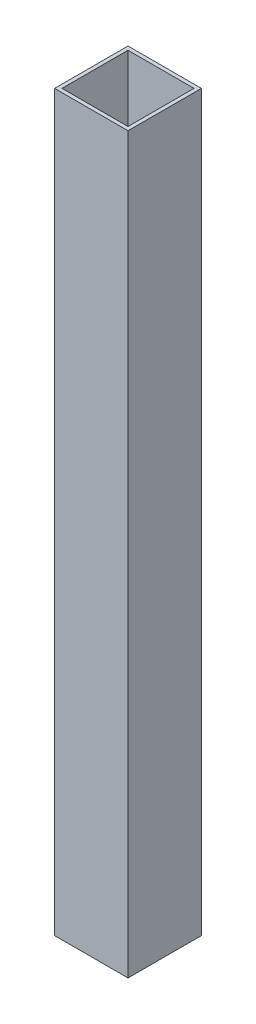
ISO-10303-21;
HEADER;
FILE_DESCRIPTION(('STEP AP214'),'2;1');
FILE_NAME('part.step','',(''),(''),'','','');
FILE_SCHEMA(('AUTOMOTIVE_DESIGN { 1 0 10303 214 1 1 1 1 }'));
ENDSEC;
DATA;
#1=APPLICATION_CONTEXT('core data for automotive mechanical design processes');
#2=APPLICATION_PROTOCOL_DEFINITION('international standard','automotive_design',2000,#1);
#3=PRODUCT_CONTEXT('',#1,'mechanical');
#4=PRODUCT('Part','Part','',(#3));
#5=PRODUCT_RELATED_PRODUCT_CATEGORY('part','',(#4));
#6=PRODUCT_DEFINITION_FORMATION('','',#4);
#7=PRODUCT_DEFINITION_CONTEXT('part definition',#1,'design');
#8=PRODUCT_DEFINITION('design','',#6,#7);
#9=PRODUCT_DEFINITION_SHAPE('','',#8);
#10=(LENGTH_UNIT() NAMED_UNIT(*) SI_UNIT(.MILLI.,.METRE.));
#11=(NAMED_UNIT(*) PLANE_ANGLE_UNIT() SI_UNIT($,.RADIAN.));
#12=(NAMED_UNIT(*) SI_UNIT($,.STERADIAN.) SOLID_ANGLE_UNIT());
#13=UNCERTAINTY_MEASURE_WITH_UNIT(LENGTH_MEASURE(1.E-05),#10,'distance_accuracy_value','');
#14=(GEOMETRIC_REPRESENTATION_CONTEXT(3) GLOBAL_UNCERTAINTY_ASSIGNED_CONTEXT((#13)) GLOBAL_UNIT_ASSIGNED_CONTEXT((#10,
#11,#12)) REPRESENTATION_CONTEXT('',''));
#15=CARTESIAN_POINT('',(0.,0.,0.));
#16=DIRECTION('',(0.,0.,1.));
#17=DIRECTION('',(1.,0.,0.));
#18=AXIS2_PLACEMENT_3D('',#15,#16,#17);
#19=CARTESIAN_POINT('',(0.,200.,0.));
#20=DIRECTION('',(0.,-1.,0.));
#21=DIRECTION('',(0.,0.,-1.));
#22=AXIS2_PLACEMENT_3D('',#19,#20,#21);
#23=PLANE('',#22);
#24=DIRECTION('',(0.,0.,-1.));
#25=VECTOR('',#24,1.);
#26=CARTESIAN_POINT('',(10.,200.,10.));
#27=LINE('',#26,#25);
#28=CARTESIAN_POINT('',(10.,200.,10.));
#29=VERTEX_POINT('',#28);
#30=CARTESIAN_POINT('',(10.,200.,-10.));
#31=VERTEX_POINT('',#30);
#32=EDGE_CURVE('E137',#29,#31,#27,.T.);
#33=ORIENTED_EDGE('',*,*,#32,.T.);
#34=DIRECTION('',(-1.,0.,0.));
#35=VECTOR('',#34,1.);
#36=CARTESIAN_POINT('',(-10.,200.,-10.));
#37=LINE('',#36,#35);
#38=CARTESIAN_POINT('',(-10.,200.,-10.));
#39=VERTEX_POINT('',#38);
#40=EDGE_CURVE('E140',#31,#39,#37,.T.);
#41=ORIENTED_EDGE('',*,*,#40,.T.);
#42=DIRECTION('',(0.,0.,1.));
#43=VECTOR('',#42,1.);
#44=CARTESIAN_POINT('',(-10.,200.,10.));
#45=LINE('',#44,#43);
#46=CARTESIAN_POINT('',(-10.,200.,10.));
#47=VERTEX_POINT('',#46);
#48=EDGE_CURVE('E143',#39,#47,#45,.T.);
#49=ORIENTED_EDGE('',*,*,#48,.T.);
#50=DIRECTION('',(1.,0.,0.));
#51=VECTOR('',#50,1.);
#52=CARTESIAN_POINT('',(-10.,200.,10.));
#53=LINE('',#52,#51);
#54=EDGE_CURVE('E145',#47,#29,#53,.T.);
#55=ORIENTED_EDGE('',*,*,#54,.T.);
#56=EDGE_LOOP('',(#33,#41,#49,#55));
#57=FACE_BOUND('',#56,.T.);
#58=DIRECTION('',(0.,0.,1.));
#59=VECTOR('',#58,1.);
#60=CARTESIAN_POINT('',(-9.,200.,9.));
#61=LINE('',#60,#59);
#62=CARTESIAN_POINT('',(-9.,200.,-9.));
#63=VERTEX_POINT('',#62);
#64=CARTESIAN_POINT('',(-9.,200.,9.));
#65=VERTEX_POINT('',#64);
#66=EDGE_CURVE('E101',#63,#65,#61,.T.);
#67=ORIENTED_EDGE('',*,*,#66,.F.);
#68=DIRECTION('',(-1.,0.,0.));
#69=VECTOR('',#68,1.);
#70=CARTESIAN_POINT('',(-9.,200.,-9.));
#71=LINE('',#70,#69);
#72=CARTESIAN_POINT('',(9.,200.,-9.));
#73=VERTEX_POINT('',#72);
#74=EDGE_CURVE('E123',#73,#63,#71,.T.);
#75=ORIENTED_EDGE('',*,*,#74,.F.);
#76=DIRECTION('',(0.,0.,-1.));
#77=VECTOR('',#76,1.);
#78=CARTESIAN_POINT('',(9.,200.,9.));
#79=LINE('',#78,#77);
#80=CARTESIAN_POINT('',(9.,200.,9.));
#81=VERTEX_POINT('',#80);
#82=EDGE_CURVE('E121',#81,#73,#79,.T.);
#83=ORIENTED_EDGE('',*,*,#82,.F.);
#84=DIRECTION('',(1.,0.,0.));
#85=VECTOR('',#84,1.);
#86=CARTESIAN_POINT('',(-9.,200.,9.));
#87=LINE('',#86,#85);
#88=EDGE_CURVE('E109',#65,#81,#87,.T.);
#89=ORIENTED_EDGE('',*,*,#88,.F.);
#90=EDGE_LOOP('',(#67,#75,#83,#89));
#91=FACE_BOUND('',#90,.T.);
#92=ADVANCED_FACE('F36',(#57,#91),#23,.F.);
#93=CARTESIAN_POINT('',(0.,0.,0.));
#94=DIRECTION('',(0.,-1.,0.));
#95=DIRECTION('',(0.,0.,-1.));
#96=AXIS2_PLACEMENT_3D('',#93,#94,#95);
#97=PLANE('',#96);
#98=DIRECTION('',(0.,0.,-1.));
#99=VECTOR('',#98,1.);
#100=CARTESIAN_POINT('',(10.,0.,10.));
#101=LINE('',#100,#99);
#102=CARTESIAN_POINT('',(10.,0.,10.));
#103=VERTEX_POINT('',#102);
#104=CARTESIAN_POINT('',(10.,0.,-10.));
#105=VERTEX_POINT('',#104);
#106=EDGE_CURVE('E117',#103,#105,#101,.T.);
#107=ORIENTED_EDGE('',*,*,#106,.F.);
#108=DIRECTION('',(1.,0.,0.));
#109=VECTOR('',#108,1.);
#110=CARTESIAN_POINT('',(-10.,0.,10.));
#111=LINE('',#110,#109);
#112=CARTESIAN_POINT('',(-10.,0.,10.));
#113=VERTEX_POINT('',#112);
#114=EDGE_CURVE('E141',#113,#103,#111,.T.);
#115=ORIENTED_EDGE('',*,*,#114,.F.);
#116=DIRECTION('',(0.,0.,1.));
#117=VECTOR('',#116,1.);
#118=CARTESIAN_POINT('',(-10.,0.,10.));
#119=LINE('',#118,#117);
#120=CARTESIAN_POINT('',(-10.,0.,-10.));
#121=VERTEX_POINT('',#120);
#122=EDGE_CURVE('E152',#121,#113,#119,.T.);
#123=ORIENTED_EDGE('',*,*,#122,.F.);
#124=DIRECTION('',(-1.,0.,0.));
#125=VECTOR('',#124,1.);
#126=CARTESIAN_POINT('',(-10.,0.,-10.));
#127=LINE('',#126,#125);
#128=EDGE_CURVE('E150',#105,#121,#127,.T.);
#129=ORIENTED_EDGE('',*,*,#128,.F.);
#130=EDGE_LOOP('',(#107,#115,#123,#129));
#131=FACE_BOUND('',#130,.T.);
#132=DIRECTION('',(-1.,0.,0.));
#133=VECTOR('',#132,1.);
#134=CARTESIAN_POINT('',(-9.,0.,-9.));
#135=LINE('',#134,#133);
#136=CARTESIAN_POINT('',(9.,0.,-9.));
#137=VERTEX_POINT('',#136);
#138=CARTESIAN_POINT('',(-9.,0.,-9.));
#139=VERTEX_POINT('',#138);
#140=EDGE_CURVE('E110',#137,#139,#135,.T.);
#141=ORIENTED_EDGE('',*,*,#140,.T.);
#142=DIRECTION('',(0.,0.,1.));
#143=VECTOR('',#142,1.);
#144=CARTESIAN_POINT('',(-9.,0.,9.));
#145=LINE('',#144,#143);
#146=CARTESIAN_POINT('',(-9.,0.,9.));
#147=VERTEX_POINT('',#146);
#148=EDGE_CURVE('E59',#139,#147,#145,.T.);
#149=ORIENTED_EDGE('',*,*,#148,.T.);
#150=DIRECTION('',(1.,0.,0.));
#151=VECTOR('',#150,1.);
#152=CARTESIAN_POINT('',(-9.,0.,9.));
#153=LINE('',#152,#151);
#154=CARTESIAN_POINT('',(9.,0.,9.));
#155=VERTEX_POINT('',#154);
#156=EDGE_CURVE('E116',#147,#155,#153,.T.);
#157=ORIENTED_EDGE('',*,*,#156,.T.);
#158=DIRECTION('',(0.,0.,-1.));
#159=VECTOR('',#158,1.);
#160=CARTESIAN_POINT('',(9.,0.,9.));
#161=LINE('',#160,#159);
#162=EDGE_CURVE('E129',#155,#137,#161,.T.);
#163=ORIENTED_EDGE('',*,*,#162,.T.);
#164=EDGE_LOOP('',(#141,#149,#157,#163));
#165=FACE_BOUND('',#164,.T.);
#166=ADVANCED_FACE('F170',(#131,#165),#97,.T.);
#167=CARTESIAN_POINT('',(10.,200.,10.));
#168=DIRECTION('',(-1.,0.,0.));
#169=DIRECTION('',(0.,0.,1.));
#170=AXIS2_PLACEMENT_3D('',#167,#168,#169);
#171=PLANE('',#170);
#172=ORIENTED_EDGE('',*,*,#106,.T.);
#173=DIRECTION('',(0.,-1.,0.));
#174=VECTOR('',#173,1.);
#175=CARTESIAN_POINT('',(10.,200.,-10.));
#176=LINE('',#175,#174);
#177=EDGE_CURVE('E11',#31,#105,#176,.T.);
#178=ORIENTED_EDGE('',*,*,#177,.F.);
#179=ORIENTED_EDGE('',*,*,#32,.F.);
#180=DIRECTION('',(0.,-1.,0.));
#181=VECTOR('',#180,1.);
#182=CARTESIAN_POINT('',(10.,200.,10.));
#183=LINE('',#182,#181);
#184=EDGE_CURVE('E147',#29,#103,#183,.T.);
#185=ORIENTED_EDGE('',*,*,#184,.T.);
#186=EDGE_LOOP('',(#172,#178,#179,#185));
#187=FACE_BOUND('',#186,.T.);
#188=ADVANCED_FACE('F38',(#187),#171,.F.);
#189=CARTESIAN_POINT('',(-10.,200.,-10.));
#190=DIRECTION('',(0.,0.,1.));
#191=DIRECTION('',(1.,0.,0.));
#192=AXIS2_PLACEMENT_3D('',#189,#190,#191);
#193=PLANE('',#192);
#194=ORIENTED_EDGE('',*,*,#128,.T.);
#195=DIRECTION('',(0.,-1.,0.));
#196=VECTOR('',#195,1.);
#197=CARTESIAN_POINT('',(-10.,200.,-10.));
#198=LINE('',#197,#196);
#199=EDGE_CURVE('E44',#39,#121,#198,.T.);
#200=ORIENTED_EDGE('',*,*,#199,.F.);
#201=ORIENTED_EDGE('',*,*,#40,.F.);
#202=ORIENTED_EDGE('',*,*,#177,.T.);
#203=EDGE_LOOP('',(#194,#200,#201,#202));
#204=FACE_BOUND('',#203,.T.);
#205=ADVANCED_FACE('F180',(#204),#193,.F.);
#206=CARTESIAN_POINT('',(-10.,200.,10.));
#207=DIRECTION('',(1.,0.,0.));
#208=DIRECTION('',(0.,0.,-1.));
#209=AXIS2_PLACEMENT_3D('',#206,#207,#208);
#210=PLANE('',#209);
#211=ORIENTED_EDGE('',*,*,#122,.T.);
#212=DIRECTION('',(0.,-1.,0.));
#213=VECTOR('',#212,1.);
#214=CARTESIAN_POINT('',(-10.,200.,10.));
#215=LINE('',#214,#213);
#216=EDGE_CURVE('E157',#47,#113,#215,.T.);
#217=ORIENTED_EDGE('',*,*,#216,.F.);
#218=ORIENTED_EDGE('',*,*,#48,.F.);
#219=ORIENTED_EDGE('',*,*,#199,.T.);
#220=EDGE_LOOP('',(#211,#217,#218,#219));
#221=FACE_BOUND('',#220,.T.);
#222=ADVANCED_FACE('F164',(#221),#210,.F.);
#223=CARTESIAN_POINT('',(-10.,200.,10.));
#224=DIRECTION('',(0.,0.,-1.));
#225=DIRECTION('',(-1.,0.,0.));
#226=AXIS2_PLACEMENT_3D('',#223,#224,#225);
#227=PLANE('',#226);
#228=ORIENTED_EDGE('',*,*,#114,.T.);
#229=ORIENTED_EDGE('',*,*,#184,.F.);
#230=ORIENTED_EDGE('',*,*,#54,.F.);
#231=ORIENTED_EDGE('',*,*,#216,.T.);
#232=EDGE_LOOP('',(#228,#229,#230,#231));
#233=FACE_BOUND('',#232,.T.);
#234=ADVANCED_FACE('F174',(#233),#227,.F.);
#235=CARTESIAN_POINT('',(-9.,200.,9.));
#236=DIRECTION('',(1.,0.,0.));
#237=DIRECTION('',(0.,0.,-1.));
#238=AXIS2_PLACEMENT_3D('',#235,#236,#237);
#239=PLANE('',#238);
#240=ORIENTED_EDGE('',*,*,#148,.F.);
#241=DIRECTION('',(0.,-1.,0.));
#242=VECTOR('',#241,1.);
#243=CARTESIAN_POINT('',(-9.,200.,-9.));
#244=LINE('',#243,#242);
#245=EDGE_CURVE('E105',#63,#139,#244,.T.);
#246=ORIENTED_EDGE('',*,*,#245,.F.);
#247=ORIENTED_EDGE('',*,*,#66,.T.);
#248=DIRECTION('',(0.,-1.,0.));
#249=VECTOR('',#248,1.);
#250=CARTESIAN_POINT('',(-9.,200.,9.));
#251=LINE('',#250,#249);
#252=EDGE_CURVE('E104',#65,#147,#251,.T.);
#253=ORIENTED_EDGE('',*,*,#252,.T.);
#254=EDGE_LOOP('',(#240,#246,#247,#253));
#255=FACE_BOUND('',#254,.T.);
#256=ADVANCED_FACE('F103',(#255),#239,.T.);
#257=CARTESIAN_POINT('',(-9.,200.,9.));
#258=DIRECTION('',(0.,0.,-1.));
#259=DIRECTION('',(-1.,0.,0.));
#260=AXIS2_PLACEMENT_3D('',#257,#258,#259);
#261=PLANE('',#260);
#262=ORIENTED_EDGE('',*,*,#156,.F.);
#263=ORIENTED_EDGE('',*,*,#252,.F.);
#264=ORIENTED_EDGE('',*,*,#88,.T.);
#265=DIRECTION('',(0.,-1.,0.));
#266=VECTOR('',#265,1.);
#267=CARTESIAN_POINT('',(9.,200.,9.));
#268=LINE('',#267,#266);
#269=EDGE_CURVE('E118',#81,#155,#268,.T.);
#270=ORIENTED_EDGE('',*,*,#269,.T.);
#271=EDGE_LOOP('',(#262,#263,#264,#270));
#272=FACE_BOUND('',#271,.T.);
#273=ADVANCED_FACE('F113',(#272),#261,.T.);
#274=CARTESIAN_POINT('',(9.,200.,9.));
#275=DIRECTION('',(-1.,0.,0.));
#276=DIRECTION('',(0.,0.,1.));
#277=AXIS2_PLACEMENT_3D('',#274,#275,#276);
#278=PLANE('',#277);
#279=ORIENTED_EDGE('',*,*,#162,.F.);
#280=ORIENTED_EDGE('',*,*,#269,.F.);
#281=ORIENTED_EDGE('',*,*,#82,.T.);
#282=DIRECTION('',(0.,-1.,0.));
#283=VECTOR('',#282,1.);
#284=CARTESIAN_POINT('',(9.,200.,-9.));
#285=LINE('',#284,#283);
#286=EDGE_CURVE('E51',#73,#137,#285,.T.);
#287=ORIENTED_EDGE('',*,*,#286,.T.);
#288=EDGE_LOOP('',(#279,#280,#281,#287));
#289=FACE_BOUND('',#288,.T.);
#290=ADVANCED_FACE('F203',(#289),#278,.T.);
#291=CARTESIAN_POINT('',(-9.,200.,-9.));
#292=DIRECTION('',(0.,0.,1.));
#293=DIRECTION('',(1.,0.,0.));
#294=AXIS2_PLACEMENT_3D('',#291,#292,#293);
#295=PLANE('',#294);
#296=ORIENTED_EDGE('',*,*,#140,.F.);
#297=ORIENTED_EDGE('',*,*,#286,.F.);
#298=ORIENTED_EDGE('',*,*,#74,.T.);
#299=ORIENTED_EDGE('',*,*,#245,.T.);
#300=EDGE_LOOP('',(#296,#297,#298,#299));
#301=FACE_BOUND('',#300,.T.);
#302=ADVANCED_FACE('F207',(#301),#295,.T.);
#303=CLOSED_SHELL('',(#92,#166,#188,#205,#222,#234,#256,#273,#290,#302));
#304=MANIFOLD_SOLID_BREP('B2',#303);
#305=ADVANCED_BREP_SHAPE_REPRESENTATION('',(#18,#304),#14);
#306=SHAPE_DEFINITION_REPRESENTATION(#9,#305);
ENDSEC;
END-ISO-10303-21;
